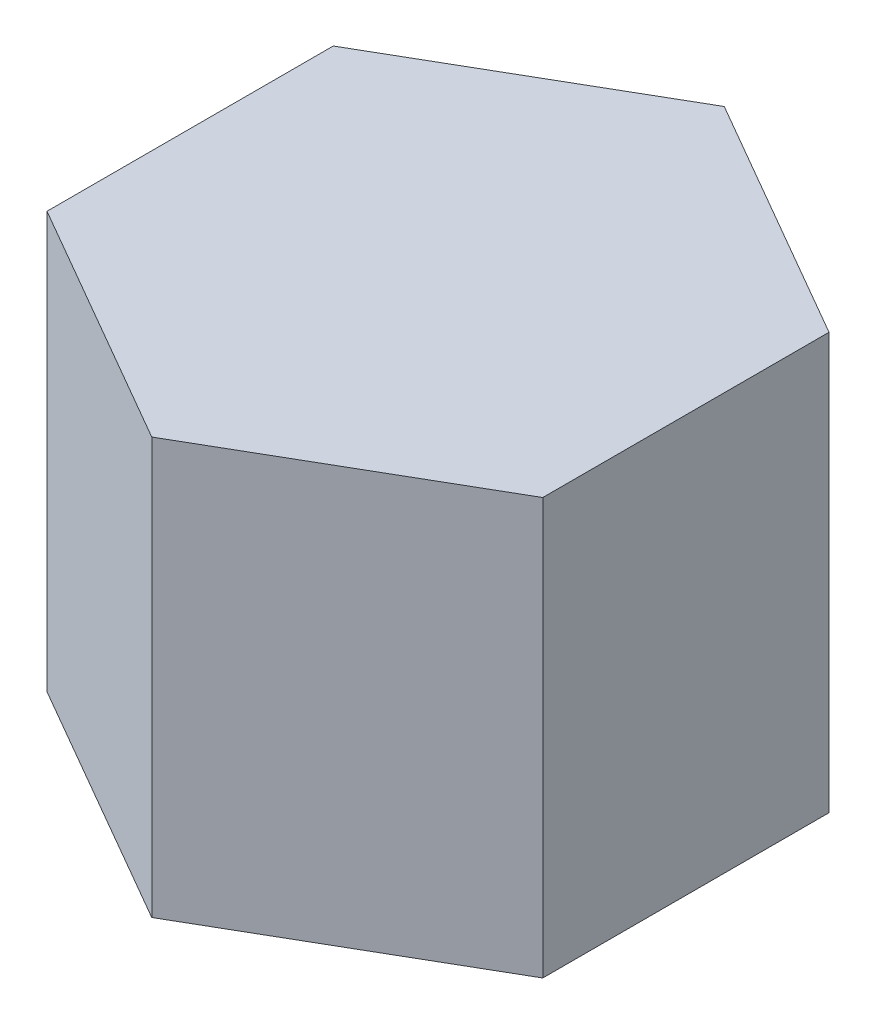
ISO-10303-21;
HEADER;
FILE_DESCRIPTION(('STEP AP214'),'2;1');
FILE_NAME('part.step','',(''),(''),'','','');
FILE_SCHEMA(('AUTOMOTIVE_DESIGN { 1 0 10303 214 1 1 1 1 }'));
ENDSEC;
DATA;
#1=APPLICATION_CONTEXT('core data for automotive mechanical design processes');
#2=APPLICATION_PROTOCOL_DEFINITION('international standard','automotive_design',2000,#1);
#3=PRODUCT_CONTEXT('',#1,'mechanical');
#4=PRODUCT('Part','Part','',(#3));
#5=PRODUCT_RELATED_PRODUCT_CATEGORY('part','',(#4));
#6=PRODUCT_DEFINITION_FORMATION('','',#4);
#7=PRODUCT_DEFINITION_CONTEXT('part definition',#1,'design');
#8=PRODUCT_DEFINITION('design','',#6,#7);
#9=PRODUCT_DEFINITION_SHAPE('','',#8);
#10=(LENGTH_UNIT() NAMED_UNIT(*) SI_UNIT(.MILLI.,.METRE.));
#11=(NAMED_UNIT(*) PLANE_ANGLE_UNIT() SI_UNIT($,.RADIAN.));
#12=(NAMED_UNIT(*) SI_UNIT($,.STERADIAN.) SOLID_ANGLE_UNIT());
#13=UNCERTAINTY_MEASURE_WITH_UNIT(LENGTH_MEASURE(1.E-05),#10,'distance_accuracy_value','');
#14=(GEOMETRIC_REPRESENTATION_CONTEXT(3) GLOBAL_UNCERTAINTY_ASSIGNED_CONTEXT((#13)) GLOBAL_UNIT_ASSIGNED_CONTEXT((#10,
#11,#12)) REPRESENTATION_CONTEXT('',''));
#15=CARTESIAN_POINT('',(0.,0.,0.));
#16=DIRECTION('',(0.,0.,1.));
#17=DIRECTION('',(1.,0.,0.));
#18=AXIS2_PLACEMENT_3D('',#15,#16,#17);
#19=CARTESIAN_POINT('',(209.339551417381,-147.556598747966,295.146072835632));
#20=DIRECTION('',(-0.500000000000062,0.,-0.866025403784403));
#21=DIRECTION('',(-0.866025403784403,0.,0.500000000000062));
#22=AXIS2_PLACEMENT_3D('',#19,#20,#21);
#23=PLANE('',#22);
#24=CARTESIAN_POINT('',(209.642660308706,-147.047793579175,294.971072835632));
#25=DIRECTION('',(-0.866025403784403,0.,0.500000000000062));
#26=VECTOR('',#25,1.);
#27=LINE('',#24,#26);
#28=CARTESIAN_POINT('',(209.642660308706,-147.047793579175,294.971072835632));
#29=VERTEX_POINT('',#28);
#30=CARTESIAN_POINT('',(209.339551417382,-147.047793579175,295.146072835632));
#31=VERTEX_POINT('',#30);
#32=EDGE_CURVE('E170',#29,#31,#27,.T.);
#33=ORIENTED_EDGE('',*,*,#32,.T.);
#34=CARTESIAN_POINT('',(209.339551417382,-147.556598747966,295.146072835632));
#35=DIRECTION('',(0.,1.,0.));
#36=VECTOR('',#35,1.);
#37=LINE('',#34,#36);
#38=CARTESIAN_POINT('',(209.339551417382,-147.556598747966,295.146072835632));
#39=VERTEX_POINT('',#38);
#40=EDGE_CURVE('E35',#39,#31,#37,.T.);
#41=ORIENTED_EDGE('',*,*,#40,.F.);
#42=CARTESIAN_POINT('',(209.642660308706,-147.556598747966,294.971072835632));
#43=DIRECTION('',(-0.866025403784403,0.,0.500000000000062));
#44=VECTOR('',#43,1.);
#45=LINE('',#42,#44);
#46=CARTESIAN_POINT('',(209.642660308706,-147.556598747966,294.971072835632));
#47=VERTEX_POINT('',#46);
#48=EDGE_CURVE('E159',#47,#39,#45,.T.);
#49=ORIENTED_EDGE('',*,*,#48,.F.);
#50=CARTESIAN_POINT('',(209.642660308706,-147.556598747966,294.971072835632));
#51=DIRECTION('',(0.,1.,0.));
#52=VECTOR('',#51,1.);
#53=LINE('',#50,#52);
#54=EDGE_CURVE('E10',#47,#29,#53,.T.);
#55=ORIENTED_EDGE('',*,*,#54,.T.);
#56=EDGE_LOOP('',(#33,#41,#49,#55));
#57=FACE_BOUND('',#56,.T.);
#58=ADVANCED_FACE('F16',(#57),#23,.F.);
#59=CARTESIAN_POINT('',(209.642660308706,-147.556598747966,291.594471220494));
#60=DIRECTION('',(-1.,0.,0.));
#61=DIRECTION('',(0.,-1.,0.));
#62=AXIS2_PLACEMENT_3D('',#59,#60,#61);
#63=PLANE('',#62);
#64=CARTESIAN_POINT('',(209.642660308706,-147.047793579175,294.621072835632));
#65=DIRECTION('',(0.,0.,1.));
#66=VECTOR('',#65,1.);
#67=LINE('',#64,#66);
#68=CARTESIAN_POINT('',(209.642660308706,-147.047793579175,294.621072835632));
#69=VERTEX_POINT('',#68);
#70=EDGE_CURVE('E167',#69,#29,#67,.T.);
#71=ORIENTED_EDGE('',*,*,#70,.T.);
#72=ORIENTED_EDGE('',*,*,#54,.F.);
#73=CARTESIAN_POINT('',(209.642660308706,-147.556598747966,294.621072835632));
#74=DIRECTION('',(0.,0.,1.));
#75=VECTOR('',#74,1.);
#76=LINE('',#73,#75);
#77=CARTESIAN_POINT('',(209.642660308706,-147.556598747966,294.621072835632));
#78=VERTEX_POINT('',#77);
#79=EDGE_CURVE('E156',#78,#47,#76,.T.);
#80=ORIENTED_EDGE('',*,*,#79,.F.);
#81=CARTESIAN_POINT('',(209.642660308706,-147.556598747966,294.621072835632));
#82=DIRECTION('',(0.,1.,0.));
#83=VECTOR('',#82,1.);
#84=LINE('',#81,#83);
#85=EDGE_CURVE('E27',#78,#69,#84,.T.);
#86=ORIENTED_EDGE('',*,*,#85,.T.);
#87=EDGE_LOOP('',(#71,#72,#80,#86));
#88=FACE_BOUND('',#87,.T.);
#89=ADVANCED_FACE('F189',(#88),#63,.F.);
#90=CARTESIAN_POINT('',(209.642660308706,-147.556598747966,294.621072835632));
#91=DIRECTION('',(-0.500000000000096,0.,0.866025403784383));
#92=DIRECTION('',(0.866025403784383,0.,0.500000000000096));
#93=AXIS2_PLACEMENT_3D('',#90,#91,#92);
#94=PLANE('',#93);
#95=CARTESIAN_POINT('',(209.339551417382,-147.047793579175,294.446072835632));
#96=DIRECTION('',(0.866025403784383,0.,0.500000000000096));
#97=VECTOR('',#96,1.);
#98=LINE('',#95,#97);
#99=CARTESIAN_POINT('',(209.339551417382,-147.047793579175,294.446072835632));
#100=VERTEX_POINT('',#99);
#101=EDGE_CURVE('E163',#100,#69,#98,.T.);
#102=ORIENTED_EDGE('',*,*,#101,.T.);
#103=ORIENTED_EDGE('',*,*,#85,.F.);
#104=CARTESIAN_POINT('',(209.339551417382,-147.556598747966,294.446072835632));
#105=DIRECTION('',(0.866025403784383,0.,0.500000000000096));
#106=VECTOR('',#105,1.);
#107=LINE('',#104,#106);
#108=CARTESIAN_POINT('',(209.339551417382,-147.556598747966,294.446072835632));
#109=VERTEX_POINT('',#108);
#110=EDGE_CURVE('E106',#109,#78,#107,.T.);
#111=ORIENTED_EDGE('',*,*,#110,.F.);
#112=CARTESIAN_POINT('',(209.339551417382,-147.556598747966,294.446072835632));
#113=DIRECTION('',(0.,1.,0.));
#114=VECTOR('',#113,1.);
#115=LINE('',#112,#114);
#116=EDGE_CURVE('E94',#109,#100,#115,.T.);
#117=ORIENTED_EDGE('',*,*,#116,.T.);
#118=EDGE_LOOP('',(#102,#103,#111,#117));
#119=FACE_BOUND('',#118,.T.);
#120=ADVANCED_FACE('F198',(#119),#94,.F.);
#121=CARTESIAN_POINT('',(209.339551417382,-147.556598747966,294.446072835632));
#122=DIRECTION('',(0.499999999999978,0.,0.866025403784452));
#123=DIRECTION('',(0.866025403784452,0.,-0.499999999999978));
#124=AXIS2_PLACEMENT_3D('',#121,#122,#123);
#125=PLANE('',#124);
#126=CARTESIAN_POINT('',(209.036442526057,-147.047793579175,294.621072835632));
#127=DIRECTION('',(0.866025403784452,0.,-0.499999999999978));
#128=VECTOR('',#127,1.);
#129=LINE('',#126,#128);
#130=CARTESIAN_POINT('',(209.036442526057,-147.047793579175,294.621072835632));
#131=VERTEX_POINT('',#130);
#132=EDGE_CURVE('E162',#131,#100,#129,.T.);
#133=ORIENTED_EDGE('',*,*,#132,.T.);
#134=ORIENTED_EDGE('',*,*,#116,.F.);
#135=CARTESIAN_POINT('',(209.036442526057,-147.556598747966,294.621072835632));
#136=DIRECTION('',(0.866025403784452,0.,-0.499999999999978));
#137=VECTOR('',#136,1.);
#138=LINE('',#135,#137);
#139=CARTESIAN_POINT('',(209.036442526057,-147.556598747966,294.621072835632));
#140=VERTEX_POINT('',#139);
#141=EDGE_CURVE('E98',#140,#109,#138,.T.);
#142=ORIENTED_EDGE('',*,*,#141,.F.);
#143=CARTESIAN_POINT('',(209.036442526057,-147.556598747966,294.621072835632));
#144=DIRECTION('',(0.,1.,0.));
#145=VECTOR('',#144,1.);
#146=LINE('',#143,#145);
#147=EDGE_CURVE('E79',#140,#131,#146,.T.);
#148=ORIENTED_EDGE('',*,*,#147,.T.);
#149=EDGE_LOOP('',(#133,#134,#142,#148));
#150=FACE_BOUND('',#149,.T.);
#151=ADVANCED_FACE('F100',(#150),#125,.F.);
#152=CARTESIAN_POINT('',(209.036442526057,-147.556598747966,291.594471220494));
#153=DIRECTION('',(1.,0.,0.));
#154=DIRECTION('',(0.,1.,0.));
#155=AXIS2_PLACEMENT_3D('',#152,#153,#154);
#156=PLANE('',#155);
#157=CARTESIAN_POINT('',(209.036442526057,-147.047793579175,294.971072835632));
#158=DIRECTION('',(0.,0.,-1.));
#159=VECTOR('',#158,1.);
#160=LINE('',#157,#159);
#161=CARTESIAN_POINT('',(209.036442526057,-147.047793579175,294.971072835632));
#162=VERTEX_POINT('',#161);
#163=EDGE_CURVE('E88',#162,#131,#160,.T.);
#164=ORIENTED_EDGE('',*,*,#163,.T.);
#165=ORIENTED_EDGE('',*,*,#147,.F.);
#166=CARTESIAN_POINT('',(209.036442526057,-147.556598747966,294.971072835632));
#167=DIRECTION('',(0.,0.,-1.));
#168=VECTOR('',#167,1.);
#169=LINE('',#166,#168);
#170=CARTESIAN_POINT('',(209.036442526057,-147.556598747966,294.971072835632));
#171=VERTEX_POINT('',#170);
#172=EDGE_CURVE('E84',#171,#140,#169,.T.);
#173=ORIENTED_EDGE('',*,*,#172,.F.);
#174=CARTESIAN_POINT('',(209.036442526057,-147.556598747966,294.971072835632));
#175=DIRECTION('',(0.,1.,0.));
#176=VECTOR('',#175,1.);
#177=LINE('',#174,#176);
#178=EDGE_CURVE('E58',#171,#162,#177,.T.);
#179=ORIENTED_EDGE('',*,*,#178,.T.);
#180=EDGE_LOOP('',(#164,#165,#173,#179));
#181=FACE_BOUND('',#180,.T.);
#182=ADVANCED_FACE('F82',(#181),#156,.F.);
#183=CARTESIAN_POINT('',(209.036442526057,-147.556598747966,294.971072835632));
#184=DIRECTION('',(0.500000000000062,0.,-0.866025403784403));
#185=DIRECTION('',(-0.866025403784403,0.,-0.500000000000062));
#186=AXIS2_PLACEMENT_3D('',#183,#184,#185);
#187=PLANE('',#186);
#188=CARTESIAN_POINT('',(209.339551417382,-147.047793579175,295.146072835632));
#189=DIRECTION('',(-0.866025403784403,0.,-0.500000000000062));
#190=VECTOR('',#189,1.);
#191=LINE('',#188,#190);
#192=EDGE_CURVE('E160',#31,#162,#191,.T.);
#193=ORIENTED_EDGE('',*,*,#192,.T.);
#194=ORIENTED_EDGE('',*,*,#178,.F.);
#195=CARTESIAN_POINT('',(209.339551417382,-147.556598747966,295.146072835632));
#196=DIRECTION('',(-0.866025403784403,0.,-0.500000000000062));
#197=VECTOR('',#196,1.);
#198=LINE('',#195,#197);
#199=EDGE_CURVE('E112',#39,#171,#198,.T.);
#200=ORIENTED_EDGE('',*,*,#199,.F.);
#201=ORIENTED_EDGE('',*,*,#40,.T.);
#202=EDGE_LOOP('',(#193,#194,#200,#201));
#203=FACE_BOUND('',#202,.T.);
#204=ADVANCED_FACE('F131',(#203),#187,.F.);
#205=CARTESIAN_POINT('',(206.491105863044,-147.556598747966,291.594471220494));
#206=DIRECTION('',(0.,1.,0.));
#207=DIRECTION('',(-1.,0.,0.));
#208=AXIS2_PLACEMENT_3D('',#205,#206,#207);
#209=PLANE('',#208);
#210=ORIENTED_EDGE('',*,*,#48,.T.);
#211=ORIENTED_EDGE('',*,*,#199,.T.);
#212=ORIENTED_EDGE('',*,*,#172,.T.);
#213=ORIENTED_EDGE('',*,*,#141,.T.);
#214=ORIENTED_EDGE('',*,*,#110,.T.);
#215=ORIENTED_EDGE('',*,*,#79,.T.);
#216=EDGE_LOOP('',(#210,#211,#212,#213,#214,#215));
#217=FACE_BOUND('',#216,.T.);
#218=ADVANCED_FACE('F111',(#217),#209,.F.);
#219=CARTESIAN_POINT('',(206.491105863044,-147.047793579175,291.594471220494));
#220=DIRECTION('',(0.,1.,0.));
#221=DIRECTION('',(-1.,0.,0.));
#222=AXIS2_PLACEMENT_3D('',#219,#220,#221);
#223=PLANE('',#222);
#224=ORIENTED_EDGE('',*,*,#32,.F.);
#225=ORIENTED_EDGE('',*,*,#70,.F.);
#226=ORIENTED_EDGE('',*,*,#101,.F.);
#227=ORIENTED_EDGE('',*,*,#132,.F.);
#228=ORIENTED_EDGE('',*,*,#163,.F.);
#229=ORIENTED_EDGE('',*,*,#192,.F.);
#230=EDGE_LOOP('',(#224,#225,#226,#227,#228,#229));
#231=FACE_BOUND('',#230,.T.);
#232=ADVANCED_FACE('F130',(#231),#223,.T.);
#233=CLOSED_SHELL('',(#58,#89,#120,#151,#182,#204,#218,#232));
#234=MANIFOLD_SOLID_BREP('B1',#233);
#235=ADVANCED_BREP_SHAPE_REPRESENTATION('',(#18,#234),#14);
#236=SHAPE_DEFINITION_REPRESENTATION(#9,#235);
ENDSEC;
END-ISO-10303-21;
